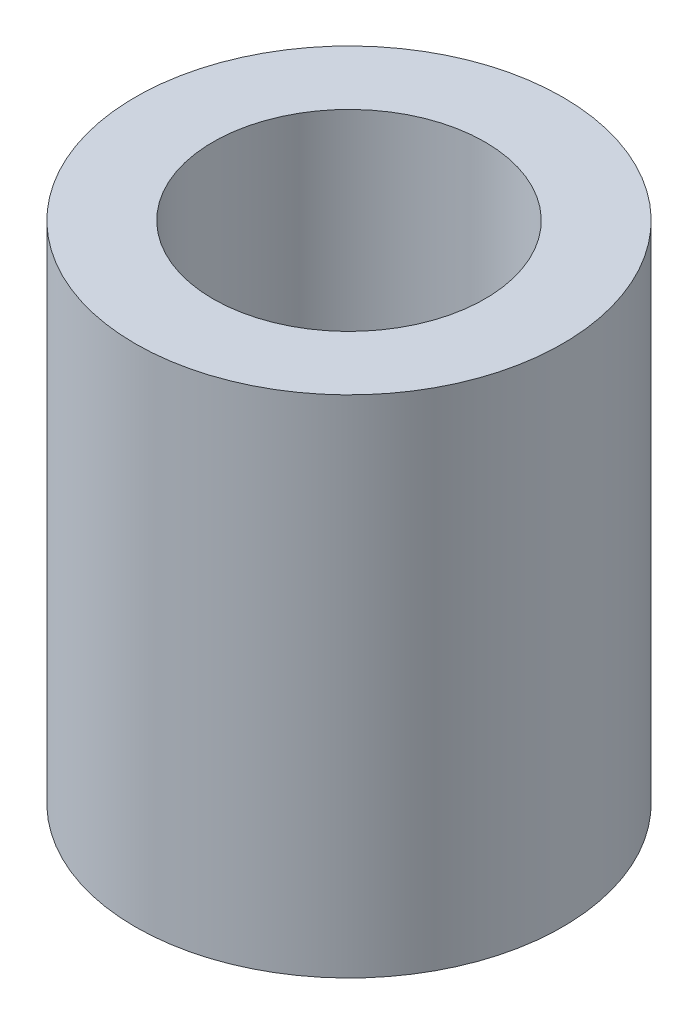
ISO-10303-21;
HEADER;
FILE_DESCRIPTION(('STEP AP214'),'2;1');
FILE_NAME('part.step','',(''),(''),'','','');
FILE_SCHEMA(('AUTOMOTIVE_DESIGN { 1 0 10303 214 1 1 1 1 }'));
ENDSEC;
DATA;
#1=APPLICATION_CONTEXT('core data for automotive mechanical design processes');
#2=APPLICATION_PROTOCOL_DEFINITION('international standard','automotive_design',2000,#1);
#3=PRODUCT_CONTEXT('',#1,'mechanical');
#4=PRODUCT('Part','Part','',(#3));
#5=PRODUCT_RELATED_PRODUCT_CATEGORY('part','',(#4));
#6=PRODUCT_DEFINITION_FORMATION('','',#4);
#7=PRODUCT_DEFINITION_CONTEXT('part definition',#1,'design');
#8=PRODUCT_DEFINITION('design','',#6,#7);
#9=PRODUCT_DEFINITION_SHAPE('','',#8);
#10=(LENGTH_UNIT() NAMED_UNIT(*) SI_UNIT(.MILLI.,.METRE.));
#11=(NAMED_UNIT(*) PLANE_ANGLE_UNIT() SI_UNIT($,.RADIAN.));
#12=(NAMED_UNIT(*) SI_UNIT($,.STERADIAN.) SOLID_ANGLE_UNIT());
#13=UNCERTAINTY_MEASURE_WITH_UNIT(LENGTH_MEASURE(1.E-05),#10,'distance_accuracy_value','');
#14=(GEOMETRIC_REPRESENTATION_CONTEXT(3) GLOBAL_UNCERTAINTY_ASSIGNED_CONTEXT((#13)) GLOBAL_UNIT_ASSIGNED_CONTEXT((#10,
#11,#12)) REPRESENTATION_CONTEXT('',''));
#15=CARTESIAN_POINT('',(0.,0.,0.));
#16=DIRECTION('',(0.,0.,1.));
#17=DIRECTION('',(1.,0.,0.));
#18=AXIS2_PLACEMENT_3D('',#15,#16,#17);
#19=CARTESIAN_POINT('',(0.,6.5,0.));
#20=DIRECTION('',(0.,1.,0.));
#21=DIRECTION('',(0.,0.,1.));
#22=AXIS2_PLACEMENT_3D('',#19,#20,#21);
#23=PLANE('',#22);
#24=CARTESIAN_POINT('',(0.,6.5,0.));
#25=DIRECTION('',(0.,1.,0.));
#26=DIRECTION('',(0.,0.,1.));
#27=AXIS2_PLACEMENT_3D('',#24,#25,#26);
#28=CIRCLE('',#27,2.75);
#29=CARTESIAN_POINT('',(0.,6.5,2.75));
#30=VERTEX_POINT('',#29);
#31=EDGE_CURVE('E10',#30,#30,#28,.T.);
#32=ORIENTED_EDGE('',*,*,#31,.T.);
#33=EDGE_LOOP('',(#32));
#34=FACE_BOUND('',#33,.T.);
#35=CARTESIAN_POINT('',(0.,6.5,0.));
#36=DIRECTION('',(0.,1.,0.));
#37=DIRECTION('',(0.,0.,1.));
#38=AXIS2_PLACEMENT_3D('',#35,#36,#37);
#39=CIRCLE('',#38,1.75);
#40=CARTESIAN_POINT('',(0.,6.5,1.75));
#41=VERTEX_POINT('',#40);
#42=EDGE_CURVE('E50',#41,#41,#39,.T.);
#43=ORIENTED_EDGE('',*,*,#42,.F.);
#44=EDGE_LOOP('',(#43));
#45=FACE_BOUND('',#44,.T.);
#46=ADVANCED_FACE('F37',(#34,#45),#23,.T.);
#47=CARTESIAN_POINT('',(0.,0.,0.));
#48=DIRECTION('',(0.,1.,0.));
#49=DIRECTION('',(0.,0.,1.));
#50=AXIS2_PLACEMENT_3D('',#47,#48,#49);
#51=PLANE('',#50);
#52=CARTESIAN_POINT('',(0.,0.,0.));
#53=DIRECTION('',(0.,1.,0.));
#54=DIRECTION('',(0.,0.,1.));
#55=AXIS2_PLACEMENT_3D('',#52,#53,#54);
#56=CIRCLE('',#55,2.75);
#57=CARTESIAN_POINT('',(0.,0.,2.75));
#58=VERTEX_POINT('',#57);
#59=EDGE_CURVE('E41',#58,#58,#56,.T.);
#60=ORIENTED_EDGE('',*,*,#59,.F.);
#61=EDGE_LOOP('',(#60));
#62=FACE_BOUND('',#61,.T.);
#63=CARTESIAN_POINT('',(0.,0.,0.));
#64=DIRECTION('',(0.,1.,0.));
#65=DIRECTION('',(0.,0.,1.));
#66=AXIS2_PLACEMENT_3D('',#63,#64,#65);
#67=CIRCLE('',#66,1.75);
#68=CARTESIAN_POINT('',(0.,0.,1.75));
#69=VERTEX_POINT('',#68);
#70=EDGE_CURVE('E52',#69,#69,#67,.T.);
#71=ORIENTED_EDGE('',*,*,#70,.T.);
#72=EDGE_LOOP('',(#71));
#73=FACE_BOUND('',#72,.T.);
#74=ADVANCED_FACE('F64',(#62,#73),#51,.F.);
#75=CARTESIAN_POINT('',(0.,6.5,0.));
#76=DIRECTION('',(0.,-1.,0.));
#77=DIRECTION('',(0.,0.,-1.));
#78=AXIS2_PLACEMENT_3D('',#75,#76,#77);
#79=CYLINDRICAL_SURFACE('',#78,2.75);
#80=ORIENTED_EDGE('',*,*,#31,.F.);
#81=EDGE_LOOP('',(#80));
#82=FACE_BOUND('',#81,.T.);
#83=ORIENTED_EDGE('',*,*,#59,.T.);
#84=EDGE_LOOP('',(#83));
#85=FACE_BOUND('',#84,.T.);
#86=ADVANCED_FACE('F39',(#82,#85),#79,.T.);
#87=CARTESIAN_POINT('',(0.,6.5,0.));
#88=DIRECTION('',(0.,-1.,0.));
#89=DIRECTION('',(0.,0.,-1.));
#90=AXIS2_PLACEMENT_3D('',#87,#88,#89);
#91=CYLINDRICAL_SURFACE('',#90,1.75);
#92=ORIENTED_EDGE('',*,*,#42,.T.);
#93=EDGE_LOOP('',(#92));
#94=FACE_BOUND('',#93,.T.);
#95=ORIENTED_EDGE('',*,*,#70,.F.);
#96=EDGE_LOOP('',(#95));
#97=FACE_BOUND('',#96,.T.);
#98=ADVANCED_FACE('F60',(#94,#97),#91,.F.);
#99=CLOSED_SHELL('',(#46,#74,#86,#98));
#100=MANIFOLD_SOLID_BREP('B2',#99);
#101=ADVANCED_BREP_SHAPE_REPRESENTATION('',(#18,#100),#14);
#102=SHAPE_DEFINITION_REPRESENTATION(#9,#101);
ENDSEC;
END-ISO-10303-21;
